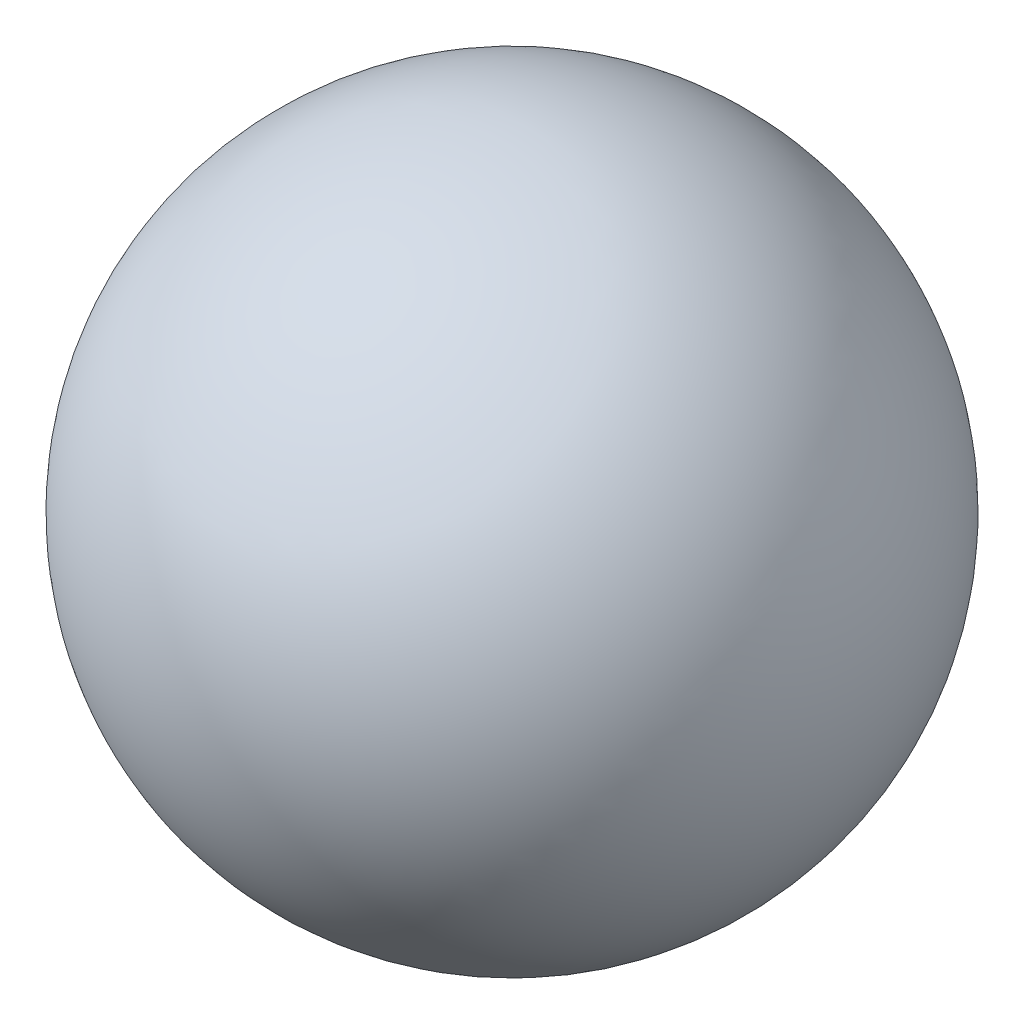
ISO-10303-21;
HEADER;
FILE_DESCRIPTION(('STEP AP214'),'2;1');
FILE_NAME('part.step','',(''),(''),'','','');
FILE_SCHEMA(('AUTOMOTIVE_DESIGN { 1 0 10303 214 1 1 1 1 }'));
ENDSEC;
DATA;
#1=APPLICATION_CONTEXT('core data for automotive mechanical design processes');
#2=APPLICATION_PROTOCOL_DEFINITION('international standard','automotive_design',2000,#1);
#3=PRODUCT_CONTEXT('',#1,'mechanical');
#4=PRODUCT('Part','Part','',(#3));
#5=PRODUCT_RELATED_PRODUCT_CATEGORY('part','',(#4));
#6=PRODUCT_DEFINITION_FORMATION('','',#4);
#7=PRODUCT_DEFINITION_CONTEXT('part definition',#1,'design');
#8=PRODUCT_DEFINITION('design','',#6,#7);
#9=PRODUCT_DEFINITION_SHAPE('','',#8);
#10=(LENGTH_UNIT() NAMED_UNIT(*) SI_UNIT(.MILLI.,.METRE.));
#11=(NAMED_UNIT(*) PLANE_ANGLE_UNIT() SI_UNIT($,.RADIAN.));
#12=(NAMED_UNIT(*) SI_UNIT($,.STERADIAN.) SOLID_ANGLE_UNIT());
#13=UNCERTAINTY_MEASURE_WITH_UNIT(LENGTH_MEASURE(1.E-05),#10,'distance_accuracy_value','');
#14=(GEOMETRIC_REPRESENTATION_CONTEXT(3) GLOBAL_UNCERTAINTY_ASSIGNED_CONTEXT((#13)) GLOBAL_UNIT_ASSIGNED_CONTEXT((#10,
#11,#12)) REPRESENTATION_CONTEXT('',''));
#15=CARTESIAN_POINT('',(0.,0.,0.));
#16=DIRECTION('',(0.,0.,1.));
#17=DIRECTION('',(1.,0.,0.));
#18=AXIS2_PLACEMENT_3D('',#15,#16,#17);
#19=CARTESIAN_POINT('',(-9.57126743659144,-2.,6.81566868746158));
#20=DIRECTION('',(0.,0.,1.));
#21=DIRECTION('',(1.,0.,0.));
#22=AXIS2_PLACEMENT_3D('',#19,#20,#21);
#23=SPHERICAL_SURFACE('',#22,1.05);
#24=CARTESIAN_POINT('',(-9.57126743659144,-2.,7.86566868746158));
#25=VERTEX_POINT('',#24);
#26=VERTEX_LOOP('',#25);
#27=FACE_BOUND('',#26,.T.);
#28=ADVANCED_FACE('F13',(#27),#23,.T.);
#29=CLOSED_SHELL('',(#28));
#30=MANIFOLD_SOLID_BREP('B1',#29);
#31=ADVANCED_BREP_SHAPE_REPRESENTATION('',(#18,#30),#14);
#32=SHAPE_DEFINITION_REPRESENTATION(#9,#31);
ENDSEC;
END-ISO-10303-21;
